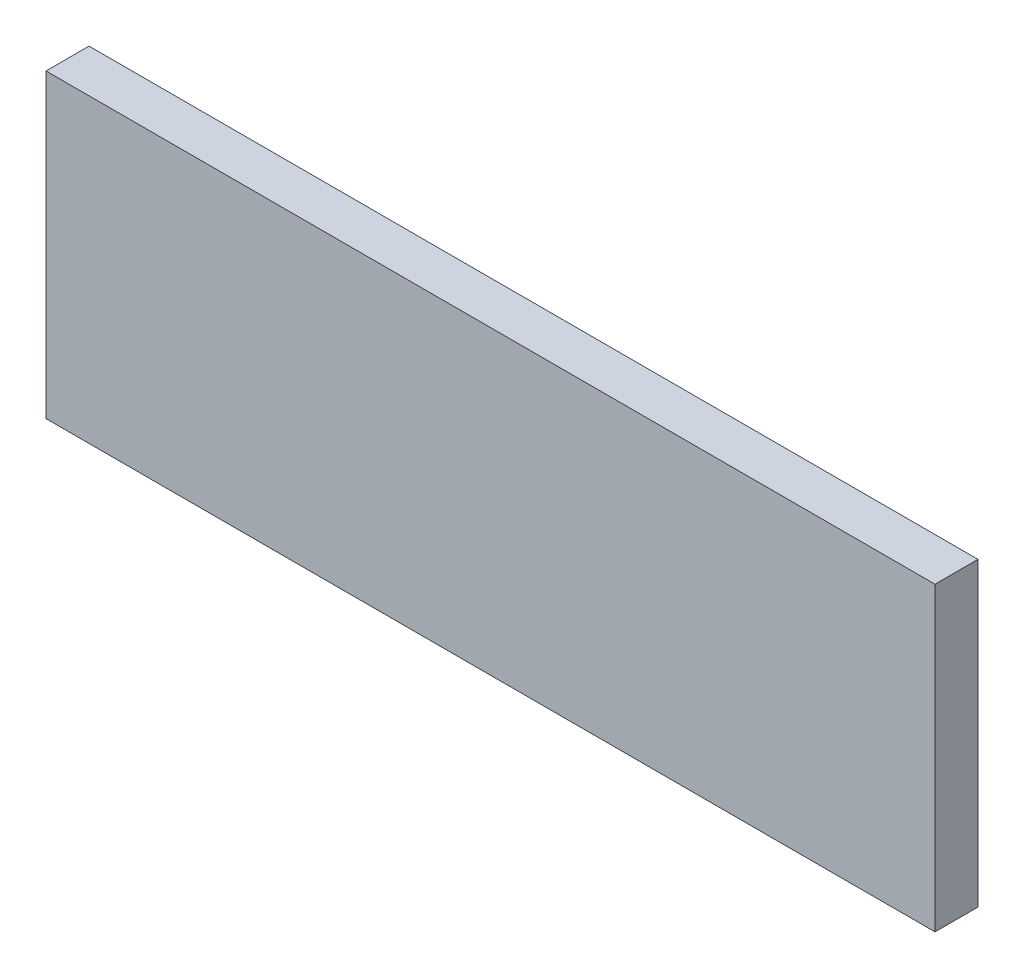
ISO-10303-21;
HEADER;
FILE_DESCRIPTION(('STEP AP214'),'2;1');
FILE_NAME('part.step','',(''),(''),'','','');
FILE_SCHEMA(('AUTOMOTIVE_DESIGN { 1 0 10303 214 1 1 1 1 }'));
ENDSEC;
DATA;
#1=APPLICATION_CONTEXT('core data for automotive mechanical design processes');
#2=APPLICATION_PROTOCOL_DEFINITION('international standard','automotive_design',2000,#1);
#3=PRODUCT_CONTEXT('',#1,'mechanical');
#4=PRODUCT('Part','Part','',(#3));
#5=PRODUCT_RELATED_PRODUCT_CATEGORY('part','',(#4));
#6=PRODUCT_DEFINITION_FORMATION('','',#4);
#7=PRODUCT_DEFINITION_CONTEXT('part definition',#1,'design');
#8=PRODUCT_DEFINITION('design','',#6,#7);
#9=PRODUCT_DEFINITION_SHAPE('','',#8);
#10=(LENGTH_UNIT() NAMED_UNIT(*) SI_UNIT(.MILLI.,.METRE.));
#11=(NAMED_UNIT(*) PLANE_ANGLE_UNIT() SI_UNIT($,.RADIAN.));
#12=(NAMED_UNIT(*) SI_UNIT($,.STERADIAN.) SOLID_ANGLE_UNIT());
#13=UNCERTAINTY_MEASURE_WITH_UNIT(LENGTH_MEASURE(1.E-05),#10,'distance_accuracy_value','');
#14=(GEOMETRIC_REPRESENTATION_CONTEXT(3) GLOBAL_UNCERTAINTY_ASSIGNED_CONTEXT((#13)) GLOBAL_UNIT_ASSIGNED_CONTEXT((#10,
#11,#12)) REPRESENTATION_CONTEXT('',''));
#15=CARTESIAN_POINT('',(0.,0.,0.));
#16=DIRECTION('',(0.,0.,1.));
#17=DIRECTION('',(1.,0.,0.));
#18=AXIS2_PLACEMENT_3D('',#15,#16,#17);
#19=CARTESIAN_POINT('',(-15.5,5.25,0.75));
#20=DIRECTION('',(1.,0.,0.));
#21=DIRECTION('',(0.,1.,0.));
#22=AXIS2_PLACEMENT_3D('',#19,#20,#21);
#23=PLANE('',#22);
#24=DIRECTION('',(0.,-1.,0.));
#25=VECTOR('',#24,1.);
#26=CARTESIAN_POINT('',(-15.5,5.25,-0.75));
#27=LINE('',#26,#25);
#28=CARTESIAN_POINT('',(-15.5,5.25,-0.75));
#29=VERTEX_POINT('',#28);
#30=CARTESIAN_POINT('',(-15.5,-5.25,-0.75));
#31=VERTEX_POINT('',#30);
#32=EDGE_CURVE('E95',#29,#31,#27,.T.);
#33=ORIENTED_EDGE('',*,*,#32,.T.);
#34=DIRECTION('',(0.,0.,-1.));
#35=VECTOR('',#34,1.);
#36=CARTESIAN_POINT('',(-15.5,-5.25,0.75));
#37=LINE('',#36,#35);
#38=CARTESIAN_POINT('',(-15.5,-5.25,0.75));
#39=VERTEX_POINT('',#38);
#40=EDGE_CURVE('E11',#39,#31,#37,.T.);
#41=ORIENTED_EDGE('',*,*,#40,.F.);
#42=DIRECTION('',(0.,-1.,0.));
#43=VECTOR('',#42,1.);
#44=CARTESIAN_POINT('',(-15.5,5.25,0.75));
#45=LINE('',#44,#43);
#46=CARTESIAN_POINT('',(-15.5,5.25,0.75));
#47=VERTEX_POINT('',#46);
#48=EDGE_CURVE('E83',#47,#39,#45,.T.);
#49=ORIENTED_EDGE('',*,*,#48,.F.);
#50=DIRECTION('',(0.,0.,-1.));
#51=VECTOR('',#50,1.);
#52=CARTESIAN_POINT('',(-15.5,5.25,0.75));
#53=LINE('',#52,#51);
#54=EDGE_CURVE('E91',#47,#29,#53,.T.);
#55=ORIENTED_EDGE('',*,*,#54,.T.);
#56=EDGE_LOOP('',(#33,#41,#49,#55));
#57=FACE_BOUND('',#56,.T.);
#58=ADVANCED_FACE('F32',(#57),#23,.F.);
#59=CARTESIAN_POINT('',(-15.5,-5.25,0.75));
#60=DIRECTION('',(0.,1.,0.));
#61=DIRECTION('',(0.,0.,1.));
#62=AXIS2_PLACEMENT_3D('',#59,#60,#61);
#63=PLANE('',#62);
#64=DIRECTION('',(1.,0.,0.));
#65=VECTOR('',#64,1.);
#66=CARTESIAN_POINT('',(-15.5,-5.25,-0.75));
#67=LINE('',#66,#65);
#68=CARTESIAN_POINT('',(15.5,-5.25,-0.75));
#69=VERTEX_POINT('',#68);
#70=EDGE_CURVE('E87',#31,#69,#67,.T.);
#71=ORIENTED_EDGE('',*,*,#70,.T.);
#72=DIRECTION('',(0.,0.,-1.));
#73=VECTOR('',#72,1.);
#74=CARTESIAN_POINT('',(15.5,-5.25,0.75));
#75=LINE('',#74,#73);
#76=CARTESIAN_POINT('',(15.5,-5.25,0.75));
#77=VERTEX_POINT('',#76);
#78=EDGE_CURVE('E40',#77,#69,#75,.T.);
#79=ORIENTED_EDGE('',*,*,#78,.F.);
#80=DIRECTION('',(1.,0.,0.));
#81=VECTOR('',#80,1.);
#82=CARTESIAN_POINT('',(-15.5,-5.25,0.75));
#83=LINE('',#82,#81);
#84=EDGE_CURVE('E78',#39,#77,#83,.T.);
#85=ORIENTED_EDGE('',*,*,#84,.F.);
#86=ORIENTED_EDGE('',*,*,#40,.T.);
#87=EDGE_LOOP('',(#71,#79,#85,#86));
#88=FACE_BOUND('',#87,.T.);
#89=ADVANCED_FACE('F86',(#88),#63,.F.);
#90=CARTESIAN_POINT('',(15.5,5.25,0.75));
#91=DIRECTION('',(-1.,0.,0.));
#92=DIRECTION('',(0.,0.,1.));
#93=AXIS2_PLACEMENT_3D('',#90,#91,#92);
#94=PLANE('',#93);
#95=DIRECTION('',(0.,1.,0.));
#96=VECTOR('',#95,1.);
#97=CARTESIAN_POINT('',(15.5,5.25,-0.75));
#98=LINE('',#97,#96);
#99=CARTESIAN_POINT('',(15.5,5.25,-0.75));
#100=VERTEX_POINT('',#99);
#101=EDGE_CURVE('E65',#69,#100,#98,.T.);
#102=ORIENTED_EDGE('',*,*,#101,.T.);
#103=DIRECTION('',(0.,0.,-1.));
#104=VECTOR('',#103,1.);
#105=CARTESIAN_POINT('',(15.5,5.25,0.75));
#106=LINE('',#105,#104);
#107=CARTESIAN_POINT('',(15.5,5.25,0.75));
#108=VERTEX_POINT('',#107);
#109=EDGE_CURVE('E88',#108,#100,#106,.T.);
#110=ORIENTED_EDGE('',*,*,#109,.F.);
#111=DIRECTION('',(0.,1.,0.));
#112=VECTOR('',#111,1.);
#113=CARTESIAN_POINT('',(15.5,5.25,0.75));
#114=LINE('',#113,#112);
#115=EDGE_CURVE('E81',#77,#108,#114,.T.);
#116=ORIENTED_EDGE('',*,*,#115,.F.);
#117=ORIENTED_EDGE('',*,*,#78,.T.);
#118=EDGE_LOOP('',(#102,#110,#116,#117));
#119=FACE_BOUND('',#118,.T.);
#120=ADVANCED_FACE('F89',(#119),#94,.F.);
#121=CARTESIAN_POINT('',(-15.5,5.25,0.75));
#122=DIRECTION('',(0.,-1.,0.));
#123=DIRECTION('',(0.,0.,-1.));
#124=AXIS2_PLACEMENT_3D('',#121,#122,#123);
#125=PLANE('',#124);
#126=DIRECTION('',(-1.,0.,0.));
#127=VECTOR('',#126,1.);
#128=CARTESIAN_POINT('',(-15.5,5.25,-0.75));
#129=LINE('',#128,#127);
#130=EDGE_CURVE('E71',#100,#29,#129,.T.);
#131=ORIENTED_EDGE('',*,*,#130,.T.);
#132=ORIENTED_EDGE('',*,*,#54,.F.);
#133=DIRECTION('',(-1.,0.,0.));
#134=VECTOR('',#133,1.);
#135=CARTESIAN_POINT('',(-15.5,5.25,0.75));
#136=LINE('',#135,#134);
#137=EDGE_CURVE('E48',#108,#47,#136,.T.);
#138=ORIENTED_EDGE('',*,*,#137,.F.);
#139=ORIENTED_EDGE('',*,*,#109,.T.);
#140=EDGE_LOOP('',(#131,#132,#138,#139));
#141=FACE_BOUND('',#140,.T.);
#142=ADVANCED_FACE('F102',(#141),#125,.F.);
#143=CARTESIAN_POINT('',(0.,0.,0.75));
#144=DIRECTION('',(0.,0.,1.));
#145=DIRECTION('',(1.,0.,0.));
#146=AXIS2_PLACEMENT_3D('',#143,#144,#145);
#147=PLANE('',#146);
#148=ORIENTED_EDGE('',*,*,#48,.T.);
#149=ORIENTED_EDGE('',*,*,#84,.T.);
#150=ORIENTED_EDGE('',*,*,#115,.T.);
#151=ORIENTED_EDGE('',*,*,#137,.T.);
#152=EDGE_LOOP('',(#148,#149,#150,#151));
#153=FACE_BOUND('',#152,.T.);
#154=ADVANCED_FACE('F79',(#153),#147,.T.);
#155=CARTESIAN_POINT('',(0.,0.,-0.75));
#156=DIRECTION('',(0.,0.,1.));
#157=DIRECTION('',(1.,0.,0.));
#158=AXIS2_PLACEMENT_3D('',#155,#156,#157);
#159=PLANE('',#158);
#160=ORIENTED_EDGE('',*,*,#32,.F.);
#161=ORIENTED_EDGE('',*,*,#130,.F.);
#162=ORIENTED_EDGE('',*,*,#101,.F.);
#163=ORIENTED_EDGE('',*,*,#70,.F.);
#164=EDGE_LOOP('',(#160,#161,#162,#163));
#165=FACE_BOUND('',#164,.T.);
#166=ADVANCED_FACE('F105',(#165),#159,.F.);
#167=CLOSED_SHELL('',(#58,#89,#120,#142,#154,#166));
#168=MANIFOLD_SOLID_BREP('B2',#167);
#169=ADVANCED_BREP_SHAPE_REPRESENTATION('',(#18,#168),#14);
#170=SHAPE_DEFINITION_REPRESENTATION(#9,#169);
ENDSEC;
END-ISO-10303-21;
